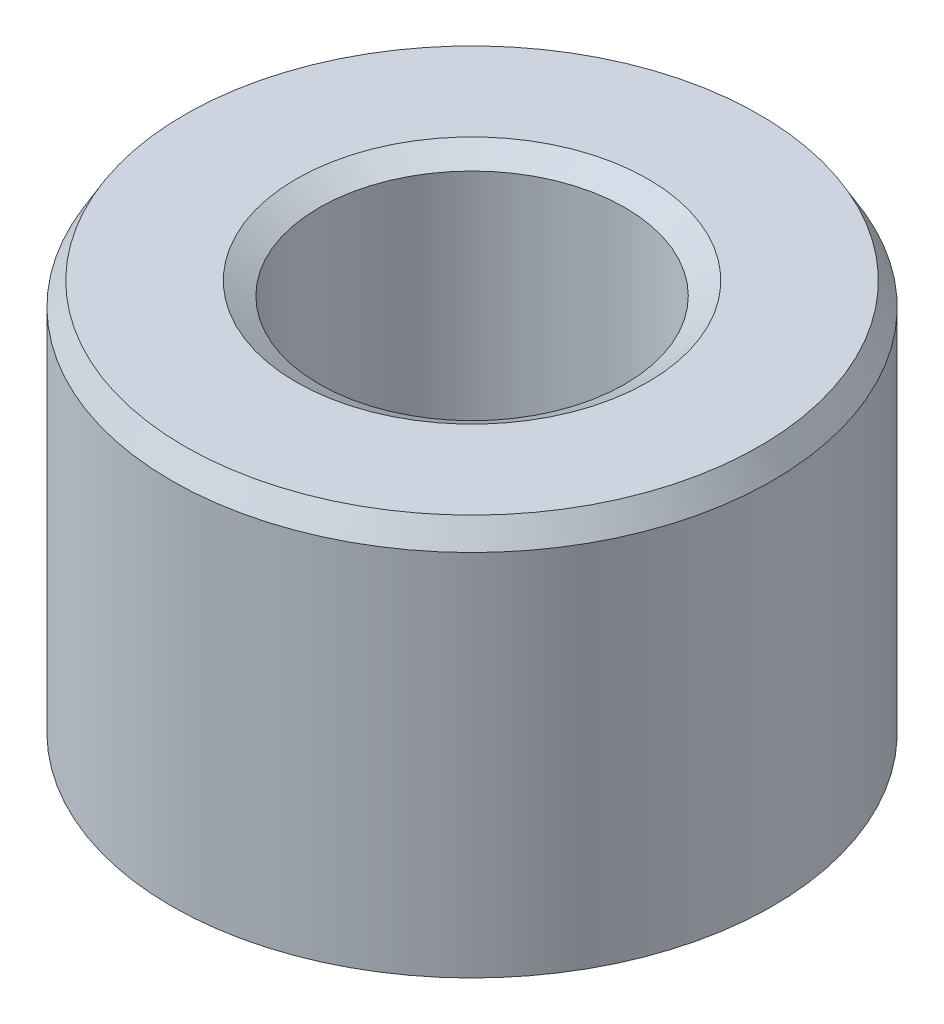
ISO-10303-21;
HEADER;
FILE_DESCRIPTION(('STEP AP214'),'2;1');
FILE_NAME('part.step','',(''),(''),'','','');
FILE_SCHEMA(('AUTOMOTIVE_DESIGN { 1 0 10303 214 1 1 1 1 }'));
ENDSEC;
DATA;
#1=APPLICATION_CONTEXT('core data for automotive mechanical design processes');
#2=APPLICATION_PROTOCOL_DEFINITION('international standard','automotive_design',2000,#1);
#3=PRODUCT_CONTEXT('',#1,'mechanical');
#4=PRODUCT('Part','Part','',(#3));
#5=PRODUCT_RELATED_PRODUCT_CATEGORY('part','',(#4));
#6=PRODUCT_DEFINITION_FORMATION('','',#4);
#7=PRODUCT_DEFINITION_CONTEXT('part definition',#1,'design');
#8=PRODUCT_DEFINITION('design','',#6,#7);
#9=PRODUCT_DEFINITION_SHAPE('','',#8);
#10=(LENGTH_UNIT() NAMED_UNIT(*) SI_UNIT(.MILLI.,.METRE.));
#11=(NAMED_UNIT(*) PLANE_ANGLE_UNIT() SI_UNIT($,.RADIAN.));
#12=(NAMED_UNIT(*) SI_UNIT($,.STERADIAN.) SOLID_ANGLE_UNIT());
#13=UNCERTAINTY_MEASURE_WITH_UNIT(LENGTH_MEASURE(1.E-05),#10,'distance_accuracy_value','');
#14=(GEOMETRIC_REPRESENTATION_CONTEXT(3) GLOBAL_UNCERTAINTY_ASSIGNED_CONTEXT((#13)) GLOBAL_UNIT_ASSIGNED_CONTEXT((#10,
#11,#12)) REPRESENTATION_CONTEXT('',''));
#15=CARTESIAN_POINT('',(0.,0.,0.));
#16=DIRECTION('',(0.,0.,1.));
#17=DIRECTION('',(1.,0.,0.));
#18=AXIS2_PLACEMENT_3D('',#15,#16,#17);
#19=CARTESIAN_POINT('',(0.,60.5879512501729,0.));
#20=DIRECTION('',(0.,-1.,0.));
#21=DIRECTION('',(0.,0.,-1.));
#22=AXIS2_PLACEMENT_3D('',#19,#20,#21);
#23=CYLINDRICAL_SURFACE('',#22,45.);
#24=CARTESIAN_POINT('',(0.,1.98853783419486,0.));
#25=DIRECTION('',(0.,1.,0.));
#26=DIRECTION('',(0.,0.,1.));
#27=AXIS2_PLACEMENT_3D('',#24,#25,#26);
#28=CIRCLE('',#27,45.);
#29=CARTESIAN_POINT('',(0.,1.98853783419486,45.));
#30=VERTEX_POINT('',#29);
#31=EDGE_CURVE('E10',#30,#30,#28,.T.);
#32=ORIENTED_EDGE('',*,*,#31,.T.);
#33=EDGE_LOOP('',(#32));
#34=FACE_BOUND('',#33,.T.);
#35=CARTESIAN_POINT('',(0.,57.1437026885744,0.));
#36=DIRECTION('',(0.,1.,0.));
#37=DIRECTION('',(0.,0.,1.));
#38=AXIS2_PLACEMENT_3D('',#35,#36,#37);
#39=CIRCLE('',#38,45.);
#40=CARTESIAN_POINT('',(0.,57.1437026885744,45.));
#41=VERTEX_POINT('',#40);
#42=EDGE_CURVE('E50',#41,#41,#39,.F.);
#43=ORIENTED_EDGE('',*,*,#42,.T.);
#44=EDGE_LOOP('',(#43));
#45=FACE_BOUND('',#44,.T.);
#46=ADVANCED_FACE('F39',(#34,#45),#23,.T.);
#47=CARTESIAN_POINT('',(0.,60.5879512501729,0.));
#48=DIRECTION('',(0.,1.,0.));
#49=DIRECTION('',(0.,0.,1.));
#50=AXIS2_PLACEMENT_3D('',#47,#48,#49);
#51=PLANE('',#50);
#52=CARTESIAN_POINT('',(0.,60.5879512501729,0.));
#53=DIRECTION('',(0.,1.,0.));
#54=DIRECTION('',(0.,0.,1.));
#55=AXIS2_PLACEMENT_3D('',#52,#53,#54);
#56=CIRCLE('',#55,26.3332048490711);
#57=CARTESIAN_POINT('',(0.,60.5879512501729,26.3332048490711));
#58=VERTEX_POINT('',#57);
#59=EDGE_CURVE('E58',#58,#58,#56,.F.);
#60=ORIENTED_EDGE('',*,*,#59,.T.);
#61=EDGE_LOOP('',(#60));
#62=FACE_BOUND('',#61,.T.);
#63=CARTESIAN_POINT('',(0.,60.5879512501729,0.));
#64=DIRECTION('',(0.,1.,0.));
#65=DIRECTION('',(0.,0.,1.));
#66=AXIS2_PLACEMENT_3D('',#63,#64,#65);
#67=CIRCLE('',#66,43.0114621658051);
#68=CARTESIAN_POINT('',(0.,60.5879512501729,43.0114621658051));
#69=VERTEX_POINT('',#68);
#70=EDGE_CURVE('E61',#69,#69,#67,.T.);
#71=ORIENTED_EDGE('',*,*,#70,.T.);
#72=EDGE_LOOP('',(#71));
#73=FACE_BOUND('',#72,.T.);
#74=ADVANCED_FACE('F88',(#62,#73),#51,.T.);
#75=CARTESIAN_POINT('',(0.,0.,0.));
#76=DIRECTION('',(0.,1.,0.));
#77=DIRECTION('',(0.,0.,1.));
#78=AXIS2_PLACEMENT_3D('',#75,#76,#77);
#79=PLANE('',#78);
#80=CARTESIAN_POINT('',(0.,0.,0.));
#81=DIRECTION('',(0.,1.,0.));
#82=DIRECTION('',(0.,0.,1.));
#83=AXIS2_PLACEMENT_3D('',#80,#81,#82);
#84=CIRCLE('',#83,24.8774941216675);
#85=CARTESIAN_POINT('',(0.,0.,24.8774941216675));
#86=VERTEX_POINT('',#85);
#87=EDGE_CURVE('E51',#86,#86,#84,.T.);
#88=ORIENTED_EDGE('',*,*,#87,.T.);
#89=EDGE_LOOP('',(#88));
#90=FACE_BOUND('',#89,.T.);
#91=CARTESIAN_POINT('',(0.,0.,0.));
#92=DIRECTION('',(0.,1.,0.));
#93=DIRECTION('',(0.,0.,1.));
#94=AXIS2_PLACEMENT_3D('',#91,#92,#93);
#95=CIRCLE('',#94,41.5557514384015);
#96=CARTESIAN_POINT('',(0.,0.,41.5557514384015));
#97=VERTEX_POINT('',#96);
#98=EDGE_CURVE('E54',#97,#97,#95,.F.);
#99=ORIENTED_EDGE('',*,*,#98,.T.);
#100=EDGE_LOOP('',(#99));
#101=FACE_BOUND('',#100,.T.);
#102=ADVANCED_FACE('F83',(#90,#101),#79,.F.);
#103=CARTESIAN_POINT('',(0.,60.5879512501729,0.));
#104=DIRECTION('',(0.,-1.,0.));
#105=DIRECTION('',(0.,0.,-1.));
#106=AXIS2_PLACEMENT_3D('',#103,#104,#105);
#107=CYLINDRICAL_SURFACE('',#106,22.8889562874726);
#108=CARTESIAN_POINT('',(0.,58.5994134159781,0.));
#109=DIRECTION('',(0.,1.,0.));
#110=DIRECTION('',(0.,0.,1.));
#111=AXIS2_PLACEMENT_3D('',#108,#109,#110);
#112=CIRCLE('',#111,22.8889562874726);
#113=CARTESIAN_POINT('',(0.,58.5994134159781,22.8889562874726));
#114=VERTEX_POINT('',#113);
#115=EDGE_CURVE('E67',#114,#114,#112,.T.);
#116=ORIENTED_EDGE('',*,*,#115,.T.);
#117=EDGE_LOOP('',(#116));
#118=FACE_BOUND('',#117,.T.);
#119=CARTESIAN_POINT('',(0.,3.44424856159848,0.));
#120=DIRECTION('',(0.,1.,0.));
#121=DIRECTION('',(0.,0.,1.));
#122=AXIS2_PLACEMENT_3D('',#119,#120,#121);
#123=CIRCLE('',#122,22.8889562874726);
#124=CARTESIAN_POINT('',(0.,3.44424856159848,22.8889562874726));
#125=VERTEX_POINT('',#124);
#126=EDGE_CURVE('E69',#125,#125,#123,.F.);
#127=ORIENTED_EDGE('',*,*,#126,.T.);
#128=EDGE_LOOP('',(#127));
#129=FACE_BOUND('',#128,.T.);
#130=ADVANCED_FACE('F71',(#118,#129),#107,.F.);
#131=CARTESIAN_POINT('',(0.,58.5994134159781,0.));
#132=DIRECTION('',(0.,1.,0.));
#133=DIRECTION('',(0.,0.,1.));
#134=AXIS2_PLACEMENT_3D('',#131,#132,#133);
#135=CONICAL_SURFACE('',#134,22.8889562874726,1.0471975511966);
#136=ORIENTED_EDGE('',*,*,#59,.F.);
#137=EDGE_LOOP('',(#136));
#138=FACE_BOUND('',#137,.T.);
#139=ORIENTED_EDGE('',*,*,#115,.F.);
#140=EDGE_LOOP('',(#139));
#141=FACE_BOUND('',#140,.T.);
#142=ADVANCED_FACE('F77',(#138,#141),#135,.F.);
#143=CARTESIAN_POINT('',(0.,0.,0.));
#144=DIRECTION('',(0.,-1.,0.));
#145=DIRECTION('',(0.,0.,-1.));
#146=AXIS2_PLACEMENT_3D('',#143,#144,#145);
#147=CONICAL_SURFACE('',#146,24.8774941216675,0.523598775598294);
#148=ORIENTED_EDGE('',*,*,#126,.F.);
#149=EDGE_LOOP('',(#148));
#150=FACE_BOUND('',#149,.T.);
#151=ORIENTED_EDGE('',*,*,#87,.F.);
#152=EDGE_LOOP('',(#151));
#153=FACE_BOUND('',#152,.T.);
#154=ADVANCED_FACE('F73',(#150,#153),#147,.F.);
#155=CARTESIAN_POINT('',(0.,1.98853783419486,0.));
#156=DIRECTION('',(0.,1.,0.));
#157=DIRECTION('',(0.,0.,1.));
#158=AXIS2_PLACEMENT_3D('',#155,#156,#157);
#159=CONICAL_SURFACE('',#158,45.,1.0471975511966);
#160=ORIENTED_EDGE('',*,*,#98,.F.);
#161=EDGE_LOOP('',(#160));
#162=FACE_BOUND('',#161,.T.);
#163=ORIENTED_EDGE('',*,*,#31,.F.);
#164=EDGE_LOOP('',(#163));
#165=FACE_BOUND('',#164,.T.);
#166=ADVANCED_FACE('F76',(#162,#165),#159,.T.);
#167=CARTESIAN_POINT('',(0.,60.5879512501729,0.));
#168=DIRECTION('',(0.,-1.,0.));
#169=DIRECTION('',(0.,0.,-1.));
#170=AXIS2_PLACEMENT_3D('',#167,#168,#169);
#171=CONICAL_SURFACE('',#170,43.0114621658051,0.523598775598291);
#172=ORIENTED_EDGE('',*,*,#42,.F.);
#173=EDGE_LOOP('',(#172));
#174=FACE_BOUND('',#173,.T.);
#175=ORIENTED_EDGE('',*,*,#70,.F.);
#176=EDGE_LOOP('',(#175));
#177=FACE_BOUND('',#176,.T.);
#178=ADVANCED_FACE('F45',(#174,#177),#171,.T.);
#179=CLOSED_SHELL('',(#46,#74,#102,#130,#142,#154,#166,#178));
#180=MANIFOLD_SOLID_BREP('B2',#179);
#181=ADVANCED_BREP_SHAPE_REPRESENTATION('',(#18,#180),#14);
#182=SHAPE_DEFINITION_REPRESENTATION(#9,#181);
ENDSEC;
END-ISO-10303-21;
